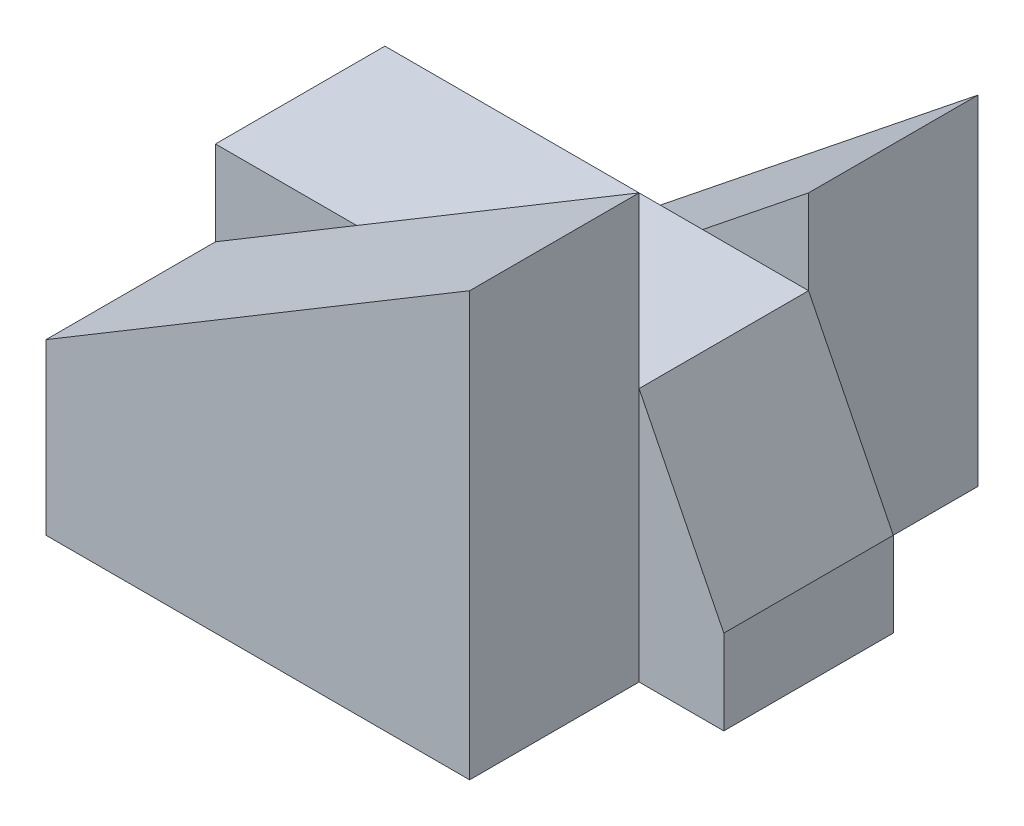
ISO-10303-21;
HEADER;
FILE_DESCRIPTION(('STEP AP214'),'2;1');
FILE_NAME('part.step','',(''),(''),'','','');
FILE_SCHEMA(('AUTOMOTIVE_DESIGN { 1 0 10303 214 1 1 1 1 }'));
ENDSEC;
DATA;
#1=APPLICATION_CONTEXT('core data for automotive mechanical design processes');
#2=APPLICATION_PROTOCOL_DEFINITION('international standard','automotive_design',2000,#1);
#3=PRODUCT_CONTEXT('',#1,'mechanical');
#4=PRODUCT('Part','Part','',(#3));
#5=PRODUCT_RELATED_PRODUCT_CATEGORY('part','',(#4));
#6=PRODUCT_DEFINITION_FORMATION('','',#4);
#7=PRODUCT_DEFINITION_CONTEXT('part definition',#1,'design');
#8=PRODUCT_DEFINITION('design','',#6,#7);
#9=PRODUCT_DEFINITION_SHAPE('','',#8);
#10=(LENGTH_UNIT() NAMED_UNIT(*) SI_UNIT(.MILLI.,.METRE.));
#11=(NAMED_UNIT(*) PLANE_ANGLE_UNIT() SI_UNIT($,.RADIAN.));
#12=(NAMED_UNIT(*) SI_UNIT($,.STERADIAN.) SOLID_ANGLE_UNIT());
#13=UNCERTAINTY_MEASURE_WITH_UNIT(LENGTH_MEASURE(1.E-05),#10,'distance_accuracy_value','');
#14=(GEOMETRIC_REPRESENTATION_CONTEXT(3) GLOBAL_UNCERTAINTY_ASSIGNED_CONTEXT((#13)) GLOBAL_UNIT_ASSIGNED_CONTEXT((#10,
#11,#12)) REPRESENTATION_CONTEXT('',''));
#15=CARTESIAN_POINT('',(0.,0.,0.));
#16=DIRECTION('',(0.,0.,1.));
#17=DIRECTION('',(1.,0.,0.));
#18=AXIS2_PLACEMENT_3D('',#15,#16,#17);
#19=CARTESIAN_POINT('',(0.,0.,20.));
#20=DIRECTION('',(0.,0.,-1.));
#21=DIRECTION('',(-1.,0.,0.));
#22=AXIS2_PLACEMENT_3D('',#19,#20,#21);
#23=PLANE('',#22);
#24=DIRECTION('',(-0.447213595499958,0.894427190999916,0.));
#25=VECTOR('',#24,1.);
#26=CARTESIAN_POINT('',(0.,15.,20.));
#27=LINE('',#26,#25);
#28=CARTESIAN_POINT('',(5.,5.,20.));
#29=VERTEX_POINT('',#28);
#30=CARTESIAN_POINT('',(0.,15.,20.));
#31=VERTEX_POINT('',#30);
#32=EDGE_CURVE('E289',#29,#31,#27,.T.);
#33=ORIENTED_EDGE('',*,*,#32,.T.);
#34=DIRECTION('',(0.,1.,0.));
#35=VECTOR('',#34,1.);
#36=CARTESIAN_POINT('',(0.,0.,20.));
#37=LINE('',#36,#35);
#38=CARTESIAN_POINT('',(0.,0.,20.));
#39=VERTEX_POINT('',#38);
#40=EDGE_CURVE('E51',#39,#31,#37,.T.);
#41=ORIENTED_EDGE('',*,*,#40,.F.);
#42=DIRECTION('',(1.,0.,0.));
#43=VECTOR('',#42,1.);
#44=CARTESIAN_POINT('',(5.,0.,20.));
#45=LINE('',#44,#43);
#46=CARTESIAN_POINT('',(5.,0.,20.));
#47=VERTEX_POINT('',#46);
#48=EDGE_CURVE('E160',#39,#47,#45,.T.);
#49=ORIENTED_EDGE('',*,*,#48,.T.);
#50=DIRECTION('',(0.,1.,0.));
#51=VECTOR('',#50,1.);
#52=CARTESIAN_POINT('',(5.,5.,20.));
#53=LINE('',#52,#51);
#54=EDGE_CURVE('E157',#47,#29,#53,.T.);
#55=ORIENTED_EDGE('',*,*,#54,.T.);
#56=EDGE_LOOP('',(#33,#41,#49,#55));
#57=FACE_BOUND('',#56,.T.);
#58=ADVANCED_FACE('F33',(#57),#23,.F.);
#59=DIRECTION('',(-0.857492925712544,-0.514495755427527,0.));
#60=VECTOR('',#59,1.);
#61=CARTESIAN_POINT('',(-25.,10.,20.));
#62=LINE('',#61,#60);
#63=CARTESIAN_POINT('',(-16.6666666666667,15.,20.));
#64=VERTEX_POINT('',#63);
#65=CARTESIAN_POINT('',(-25.,10.,20.));
#66=VERTEX_POINT('',#65);
#67=EDGE_CURVE('E37',#64,#66,#62,.T.);
#68=ORIENTED_EDGE('',*,*,#67,.F.);
#69=DIRECTION('',(-1.,0.,0.));
#70=VECTOR('',#69,1.);
#71=CARTESIAN_POINT('',(-25.,15.,20.));
#72=LINE('',#71,#70);
#73=CARTESIAN_POINT('',(-25.,15.,20.));
#74=VERTEX_POINT('',#73);
#75=EDGE_CURVE('E291',#64,#74,#72,.T.);
#76=ORIENTED_EDGE('',*,*,#75,.T.);
#77=DIRECTION('',(0.,-1.,0.));
#78=VECTOR('',#77,1.);
#79=CARTESIAN_POINT('',(-25.,0.,20.));
#80=LINE('',#79,#78);
#81=EDGE_CURVE('E167',#74,#66,#80,.T.);
#82=ORIENTED_EDGE('',*,*,#81,.T.);
#83=EDGE_LOOP('',(#68,#76,#82));
#84=FACE_BOUND('',#83,.T.);
#85=ADVANCED_FACE('F271',(#84),#23,.F.);
#86=CARTESIAN_POINT('',(0.,0.,10.));
#87=DIRECTION('',(0.,0.,-1.));
#88=DIRECTION('',(-1.,0.,0.));
#89=AXIS2_PLACEMENT_3D('',#86,#87,#88);
#90=PLANE('',#89);
#91=DIRECTION('',(-1.,0.,0.));
#92=VECTOR('',#91,1.);
#93=CARTESIAN_POINT('',(-25.,15.,10.));
#94=LINE('',#93,#92);
#95=CARTESIAN_POINT('',(0.,15.,10.));
#96=VERTEX_POINT('',#95);
#97=CARTESIAN_POINT('',(-6.25,15.,10.));
#98=VERTEX_POINT('',#97);
#99=EDGE_CURVE('E59',#96,#98,#94,.T.);
#100=ORIENTED_EDGE('',*,*,#99,.F.);
#101=DIRECTION('',(0.,1.,0.));
#102=VECTOR('',#101,1.);
#103=CARTESIAN_POINT('',(0.,0.,10.));
#104=LINE('',#103,#102);
#105=CARTESIAN_POINT('',(0.,20.,10.));
#106=VERTEX_POINT('',#105);
#107=EDGE_CURVE('E189',#96,#106,#104,.T.);
#108=ORIENTED_EDGE('',*,*,#107,.T.);
#109=DIRECTION('',(-0.78086880944303,-0.624695047554424,0.));
#110=VECTOR('',#109,1.);
#111=CARTESIAN_POINT('',(0.,20.,10.));
#112=LINE('',#111,#110);
#113=EDGE_CURVE('E188',#106,#98,#112,.T.);
#114=ORIENTED_EDGE('',*,*,#113,.T.);
#115=EDGE_LOOP('',(#100,#108,#114));
#116=FACE_BOUND('',#115,.T.);
#117=ADVANCED_FACE('F275',(#116),#90,.F.);
#118=CARTESIAN_POINT('',(0.,20.,10.));
#119=DIRECTION('',(0.624695047554424,-0.78086880944303,0.));
#120=DIRECTION('',(0.78086880944303,0.624695047554424,0.));
#121=AXIS2_PLACEMENT_3D('',#118,#119,#120);
#122=PLANE('',#121);
#123=DIRECTION('',(-0.78086880944303,-0.624695047554424,0.));
#124=VECTOR('',#123,1.);
#125=CARTESIAN_POINT('',(0.,20.,0.));
#126=LINE('',#125,#124);
#127=CARTESIAN_POINT('',(0.,20.,0.));
#128=VERTEX_POINT('',#127);
#129=CARTESIAN_POINT('',(-25.,0.,0.));
#130=VERTEX_POINT('',#129);
#131=EDGE_CURVE('E193',#128,#130,#126,.T.);
#132=ORIENTED_EDGE('',*,*,#131,.T.);
#133=DIRECTION('',(0.,0.,-1.));
#134=VECTOR('',#133,1.);
#135=CARTESIAN_POINT('',(-25.,0.,10.));
#136=LINE('',#135,#134);
#137=CARTESIAN_POINT('',(-25.,0.,10.));
#138=VERTEX_POINT('',#137);
#139=EDGE_CURVE('E11',#138,#130,#136,.T.);
#140=ORIENTED_EDGE('',*,*,#139,.F.);
#141=EDGE_CURVE('E190',#98,#138,#112,.T.);
#142=ORIENTED_EDGE('',*,*,#141,.F.);
#143=ORIENTED_EDGE('',*,*,#113,.F.);
#144=DIRECTION('',(0.,0.,-1.));
#145=VECTOR('',#144,1.);
#146=CARTESIAN_POINT('',(0.,20.,10.));
#147=LINE('',#146,#145);
#148=EDGE_CURVE('E200',#106,#128,#147,.T.);
#149=ORIENTED_EDGE('',*,*,#148,.T.);
#150=EDGE_LOOP('',(#132,#140,#142,#143,#149));
#151=FACE_BOUND('',#150,.T.);
#152=ADVANCED_FACE('F35',(#151),#122,.F.);
#153=CARTESIAN_POINT('',(-25.,0.,10.));
#154=DIRECTION('',(0.,1.,0.));
#155=DIRECTION('',(0.,0.,1.));
#156=AXIS2_PLACEMENT_3D('',#153,#154,#155);
#157=PLANE('',#156);
#158=DIRECTION('',(1.,0.,0.));
#159=VECTOR('',#158,1.);
#160=CARTESIAN_POINT('',(-25.,0.,0.));
#161=LINE('',#160,#159);
#162=CARTESIAN_POINT('',(0.,0.,0.));
#163=VERTEX_POINT('',#162);
#164=EDGE_CURVE('E196',#130,#163,#161,.T.);
#165=ORIENTED_EDGE('',*,*,#164,.T.);
#166=DIRECTION('',(0.,0.,-1.));
#167=VECTOR('',#166,1.);
#168=CARTESIAN_POINT('',(0.,0.,10.));
#169=LINE('',#168,#167);
#170=CARTESIAN_POINT('',(0.,0.,10.));
#171=VERTEX_POINT('',#170);
#172=EDGE_CURVE('E43',#171,#163,#169,.T.);
#173=ORIENTED_EDGE('',*,*,#172,.F.);
#174=DIRECTION('',(1.,0.,0.));
#175=VECTOR('',#174,1.);
#176=CARTESIAN_POINT('',(5.,0.,10.));
#177=LINE('',#176,#175);
#178=CARTESIAN_POINT('',(5.,0.,10.));
#179=VERTEX_POINT('',#178);
#180=EDGE_CURVE('E182',#171,#179,#177,.T.);
#181=ORIENTED_EDGE('',*,*,#180,.T.);
#182=DIRECTION('',(0.,0.,-1.));
#183=VECTOR('',#182,1.);
#184=CARTESIAN_POINT('',(5.,0.,20.));
#185=LINE('',#184,#183);
#186=EDGE_CURVE('E186',#47,#179,#185,.T.);
#187=ORIENTED_EDGE('',*,*,#186,.F.);
#188=ORIENTED_EDGE('',*,*,#48,.F.);
#189=DIRECTION('',(0.,0.,-1.));
#190=VECTOR('',#189,1.);
#191=CARTESIAN_POINT('',(0.,0.,30.));
#192=LINE('',#191,#190);
#193=CARTESIAN_POINT('',(0.,0.,30.));
#194=VERTEX_POINT('',#193);
#195=EDGE_CURVE('E185',#194,#39,#192,.T.);
#196=ORIENTED_EDGE('',*,*,#195,.F.);
#197=DIRECTION('',(1.,0.,0.));
#198=VECTOR('',#197,1.);
#199=CARTESIAN_POINT('',(-25.,0.,30.));
#200=LINE('',#199,#198);
#201=CARTESIAN_POINT('',(-25.,0.,30.));
#202=VERTEX_POINT('',#201);
#203=EDGE_CURVE('E130',#202,#194,#200,.T.);
#204=ORIENTED_EDGE('',*,*,#203,.F.);
#205=DIRECTION('',(0.,0.,-1.));
#206=VECTOR('',#205,1.);
#207=CARTESIAN_POINT('',(-25.,0.,20.));
#208=LINE('',#207,#206);
#209=EDGE_CURVE('E171',#202,#138,#208,.T.);
#210=ORIENTED_EDGE('',*,*,#209,.T.);
#211=ORIENTED_EDGE('',*,*,#139,.T.);
#212=EDGE_LOOP('',(#165,#173,#181,#187,#188,#196,#204,#210,#211));
#213=FACE_BOUND('',#212,.T.);
#214=ADVANCED_FACE('F299',(#213),#157,.F.);
#215=CARTESIAN_POINT('',(0.,0.,10.));
#216=DIRECTION('',(-1.,0.,0.));
#217=DIRECTION('',(0.,0.,1.));
#218=AXIS2_PLACEMENT_3D('',#215,#216,#217);
#219=PLANE('',#218);
#220=DIRECTION('',(0.,1.,0.));
#221=VECTOR('',#220,1.);
#222=CARTESIAN_POINT('',(0.,0.,0.));
#223=LINE('',#222,#221);
#224=EDGE_CURVE('E198',#163,#128,#223,.T.);
#225=ORIENTED_EDGE('',*,*,#224,.T.);
#226=ORIENTED_EDGE('',*,*,#148,.F.);
#227=ORIENTED_EDGE('',*,*,#107,.F.);
#228=EDGE_CURVE('E164',#171,#96,#104,.T.);
#229=ORIENTED_EDGE('',*,*,#228,.F.);
#230=ORIENTED_EDGE('',*,*,#172,.T.);
#231=EDGE_LOOP('',(#225,#226,#227,#229,#230));
#232=FACE_BOUND('',#231,.T.);
#233=ADVANCED_FACE('F208',(#232),#219,.F.);
#234=CARTESIAN_POINT('',(0.,0.,0.));
#235=DIRECTION('',(0.,0.,-1.));
#236=DIRECTION('',(-1.,0.,0.));
#237=AXIS2_PLACEMENT_3D('',#234,#235,#236);
#238=PLANE('',#237);
#239=ORIENTED_EDGE('',*,*,#131,.F.);
#240=ORIENTED_EDGE('',*,*,#224,.F.);
#241=ORIENTED_EDGE('',*,*,#164,.F.);
#242=EDGE_LOOP('',(#239,#240,#241));
#243=FACE_BOUND('',#242,.T.);
#244=ADVANCED_FACE('F215',(#243),#238,.T.);
#245=CARTESIAN_POINT('',(0.,0.,10.));
#246=DIRECTION('',(0.,0.,-1.));
#247=DIRECTION('',(-1.,0.,0.));
#248=AXIS2_PLACEMENT_3D('',#245,#246,#247);
#249=PLANE('',#248);
#250=CARTESIAN_POINT('',(-25.,15.,10.));
#251=VERTEX_POINT('',#250);
#252=EDGE_CURVE('E236',#98,#251,#94,.T.);
#253=ORIENTED_EDGE('',*,*,#252,.F.);
#254=ORIENTED_EDGE('',*,*,#141,.T.);
#255=DIRECTION('',(0.,-1.,0.));
#256=VECTOR('',#255,1.);
#257=CARTESIAN_POINT('',(-25.,0.,10.));
#258=LINE('',#257,#256);
#259=EDGE_CURVE('E163',#251,#138,#258,.T.);
#260=ORIENTED_EDGE('',*,*,#259,.F.);
#261=EDGE_LOOP('',(#253,#254,#260));
#262=FACE_BOUND('',#261,.T.);
#263=ADVANCED_FACE('F256',(#262),#249,.T.);
#264=CARTESIAN_POINT('',(5.,5.,20.));
#265=DIRECTION('',(-1.,0.,0.));
#266=DIRECTION('',(0.,-1.,0.));
#267=AXIS2_PLACEMENT_3D('',#264,#265,#266);
#268=PLANE('',#267);
#269=DIRECTION('',(0.,1.,0.));
#270=VECTOR('',#269,1.);
#271=CARTESIAN_POINT('',(5.,5.,10.));
#272=LINE('',#271,#270);
#273=CARTESIAN_POINT('',(5.,5.,10.));
#274=VERTEX_POINT('',#273);
#275=EDGE_CURVE('E179',#179,#274,#272,.T.);
#276=ORIENTED_EDGE('',*,*,#275,.T.);
#277=DIRECTION('',(0.,0.,-1.));
#278=VECTOR('',#277,1.);
#279=CARTESIAN_POINT('',(5.,5.,20.));
#280=LINE('',#279,#278);
#281=EDGE_CURVE('E235',#29,#274,#280,.T.);
#282=ORIENTED_EDGE('',*,*,#281,.F.);
#283=ORIENTED_EDGE('',*,*,#54,.F.);
#284=ORIENTED_EDGE('',*,*,#186,.T.);
#285=EDGE_LOOP('',(#276,#282,#283,#284));
#286=FACE_BOUND('',#285,.T.);
#287=ADVANCED_FACE('F258',(#286),#268,.F.);
#288=CARTESIAN_POINT('',(0.,15.,20.));
#289=DIRECTION('',(-0.894427190999916,-0.447213595499958,0.));
#290=DIRECTION('',(0.447213595499958,-0.894427190999916,0.));
#291=AXIS2_PLACEMENT_3D('',#288,#289,#290);
#292=PLANE('',#291);
#293=DIRECTION('',(-0.447213595499958,0.894427190999916,0.));
#294=VECTOR('',#293,1.);
#295=CARTESIAN_POINT('',(0.,15.,10.));
#296=LINE('',#295,#294);
#297=EDGE_CURVE('E225',#274,#96,#296,.T.);
#298=ORIENTED_EDGE('',*,*,#297,.T.);
#299=DIRECTION('',(0.,0.,-1.));
#300=VECTOR('',#299,1.);
#301=CARTESIAN_POINT('',(0.,15.,20.));
#302=LINE('',#301,#300);
#303=EDGE_CURVE('E232',#31,#96,#302,.T.);
#304=ORIENTED_EDGE('',*,*,#303,.F.);
#305=ORIENTED_EDGE('',*,*,#32,.F.);
#306=ORIENTED_EDGE('',*,*,#281,.T.);
#307=EDGE_LOOP('',(#298,#304,#305,#306));
#308=FACE_BOUND('',#307,.T.);
#309=ADVANCED_FACE('F230',(#308),#292,.F.);
#310=CARTESIAN_POINT('',(-25.,15.,20.));
#311=DIRECTION('',(0.,-1.,0.));
#312=DIRECTION('',(0.,0.,-1.));
#313=AXIS2_PLACEMENT_3D('',#310,#311,#312);
#314=PLANE('',#313);
#315=ORIENTED_EDGE('',*,*,#99,.T.);
#316=ORIENTED_EDGE('',*,*,#252,.T.);
#317=DIRECTION('',(0.,0.,-1.));
#318=VECTOR('',#317,1.);
#319=CARTESIAN_POINT('',(-25.,15.,20.));
#320=LINE('',#319,#318);
#321=EDGE_CURVE('E240',#74,#251,#320,.T.);
#322=ORIENTED_EDGE('',*,*,#321,.F.);
#323=ORIENTED_EDGE('',*,*,#75,.F.);
#324=EDGE_CURVE('E172',#31,#64,#72,.T.);
#325=ORIENTED_EDGE('',*,*,#324,.F.);
#326=ORIENTED_EDGE('',*,*,#303,.T.);
#327=EDGE_LOOP('',(#315,#316,#322,#323,#325,#326));
#328=FACE_BOUND('',#327,.T.);
#329=ADVANCED_FACE('F238',(#328),#314,.F.);
#330=CARTESIAN_POINT('',(-25.,0.,20.));
#331=DIRECTION('',(1.,0.,0.));
#332=DIRECTION('',(0.,0.,-1.));
#333=AXIS2_PLACEMENT_3D('',#330,#331,#332);
#334=PLANE('',#333);
#335=ORIENTED_EDGE('',*,*,#259,.T.);
#336=ORIENTED_EDGE('',*,*,#209,.F.);
#337=DIRECTION('',(0.,-1.,0.));
#338=VECTOR('',#337,1.);
#339=CARTESIAN_POINT('',(-25.,0.,30.));
#340=LINE('',#339,#338);
#341=CARTESIAN_POINT('',(-25.,10.,30.));
#342=VERTEX_POINT('',#341);
#343=EDGE_CURVE('E152',#342,#202,#340,.T.);
#344=ORIENTED_EDGE('',*,*,#343,.F.);
#345=DIRECTION('',(0.,0.,-1.));
#346=VECTOR('',#345,1.);
#347=CARTESIAN_POINT('',(-25.,10.,30.));
#348=LINE('',#347,#346);
#349=EDGE_CURVE('E134',#342,#66,#348,.T.);
#350=ORIENTED_EDGE('',*,*,#349,.T.);
#351=ORIENTED_EDGE('',*,*,#81,.F.);
#352=ORIENTED_EDGE('',*,*,#321,.T.);
#353=EDGE_LOOP('',(#335,#336,#344,#350,#351,#352));
#354=FACE_BOUND('',#353,.T.);
#355=ADVANCED_FACE('F255',(#354),#334,.F.);
#356=ORIENTED_EDGE('',*,*,#180,.F.);
#357=ORIENTED_EDGE('',*,*,#228,.T.);
#358=ORIENTED_EDGE('',*,*,#297,.F.);
#359=ORIENTED_EDGE('',*,*,#275,.F.);
#360=EDGE_LOOP('',(#356,#357,#358,#359));
#361=FACE_BOUND('',#360,.T.);
#362=ADVANCED_FACE('F223',(#361),#249,.T.);
#363=CARTESIAN_POINT('',(0.,0.,30.));
#364=DIRECTION('',(-1.,0.,0.));
#365=DIRECTION('',(0.,0.,1.));
#366=AXIS2_PLACEMENT_3D('',#363,#364,#365);
#367=PLANE('',#366);
#368=ORIENTED_EDGE('',*,*,#40,.T.);
#369=DIRECTION('',(0.,1.,0.));
#370=VECTOR('',#369,1.);
#371=CARTESIAN_POINT('',(0.,25.,20.));
#372=LINE('',#371,#370);
#373=CARTESIAN_POINT('',(0.,25.,20.));
#374=VERTEX_POINT('',#373);
#375=EDGE_CURVE('E140',#31,#374,#372,.T.);
#376=ORIENTED_EDGE('',*,*,#375,.T.);
#377=DIRECTION('',(0.,0.,-1.));
#378=VECTOR('',#377,1.);
#379=CARTESIAN_POINT('',(0.,25.,30.));
#380=LINE('',#379,#378);
#381=CARTESIAN_POINT('',(0.,25.,30.));
#382=VERTEX_POINT('',#381);
#383=EDGE_CURVE('E137',#382,#374,#380,.T.);
#384=ORIENTED_EDGE('',*,*,#383,.F.);
#385=DIRECTION('',(0.,1.,0.));
#386=VECTOR('',#385,1.);
#387=CARTESIAN_POINT('',(0.,0.,30.));
#388=LINE('',#387,#386);
#389=EDGE_CURVE('E122',#194,#382,#388,.T.);
#390=ORIENTED_EDGE('',*,*,#389,.F.);
#391=ORIENTED_EDGE('',*,*,#195,.T.);
#392=EDGE_LOOP('',(#368,#376,#384,#390,#391));
#393=FACE_BOUND('',#392,.T.);
#394=ADVANCED_FACE('F138',(#393),#367,.F.);
#395=CARTESIAN_POINT('',(0.,0.,30.));
#396=DIRECTION('',(0.,0.,-1.));
#397=DIRECTION('',(-1.,0.,0.));
#398=AXIS2_PLACEMENT_3D('',#395,#396,#397);
#399=PLANE('',#398);
#400=ORIENTED_EDGE('',*,*,#343,.T.);
#401=ORIENTED_EDGE('',*,*,#203,.T.);
#402=ORIENTED_EDGE('',*,*,#389,.T.);
#403=DIRECTION('',(-0.857492925712544,-0.514495755427527,0.));
#404=VECTOR('',#403,1.);
#405=CARTESIAN_POINT('',(-25.,10.,30.));
#406=LINE('',#405,#404);
#407=EDGE_CURVE('E127',#382,#342,#406,.T.);
#408=ORIENTED_EDGE('',*,*,#407,.T.);
#409=EDGE_LOOP('',(#400,#401,#402,#408));
#410=FACE_BOUND('',#409,.T.);
#411=ADVANCED_FACE('F125',(#410),#399,.F.);
#412=CARTESIAN_POINT('',(0.,0.,20.));
#413=DIRECTION('',(0.,0.,1.));
#414=DIRECTION('',(1.,0.,0.));
#415=AXIS2_PLACEMENT_3D('',#412,#413,#414);
#416=PLANE('',#415);
#417=ORIENTED_EDGE('',*,*,#375,.F.);
#418=ORIENTED_EDGE('',*,*,#324,.T.);
#419=EDGE_CURVE('E147',#374,#64,#62,.T.);
#420=ORIENTED_EDGE('',*,*,#419,.F.);
#421=EDGE_LOOP('',(#417,#418,#420));
#422=FACE_BOUND('',#421,.T.);
#423=ADVANCED_FACE('F282',(#422),#416,.F.);
#424=CARTESIAN_POINT('',(-25.,10.,30.));
#425=DIRECTION('',(0.514495755427527,-0.857492925712544,0.));
#426=DIRECTION('',(0.857492925712544,0.514495755427527,0.));
#427=AXIS2_PLACEMENT_3D('',#424,#425,#426);
#428=PLANE('',#427);
#429=ORIENTED_EDGE('',*,*,#419,.T.);
#430=ORIENTED_EDGE('',*,*,#67,.T.);
#431=ORIENTED_EDGE('',*,*,#349,.F.);
#432=ORIENTED_EDGE('',*,*,#407,.F.);
#433=ORIENTED_EDGE('',*,*,#383,.T.);
#434=EDGE_LOOP('',(#429,#430,#431,#432,#433));
#435=FACE_BOUND('',#434,.T.);
#436=ADVANCED_FACE('F145',(#435),#428,.F.);
#437=CLOSED_SHELL('',(#58,#85,#117,#152,#214,#233,#244,#263,#287,#309,#329,#355,#362,#394,#411,
#423,#436));
#438=MANIFOLD_SOLID_BREP('B2',#437);
#439=ADVANCED_BREP_SHAPE_REPRESENTATION('',(#18,#438),#14);
#440=SHAPE_DEFINITION_REPRESENTATION(#9,#439);
ENDSEC;
END-ISO-10303-21;
